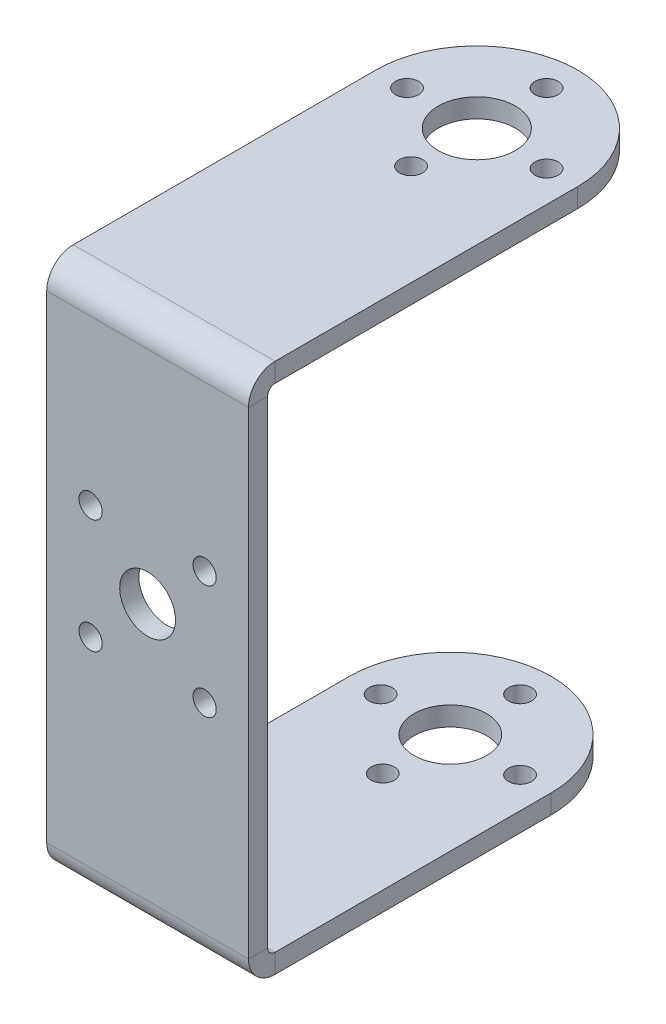
ISO-10303-21;
HEADER;
FILE_DESCRIPTION(('STEP AP214'),'2;1');
FILE_NAME('part.step','',(''),(''),'','','');
FILE_SCHEMA(('AUTOMOTIVE_DESIGN { 1 0 10303 214 1 1 1 1 }'));
ENDSEC;
DATA;
#1=APPLICATION_CONTEXT('core data for automotive mechanical design processes');
#2=APPLICATION_PROTOCOL_DEFINITION('international standard','automotive_design',2000,#1);
#3=PRODUCT_CONTEXT('',#1,'mechanical');
#4=PRODUCT('Part','Part','',(#3));
#5=PRODUCT_RELATED_PRODUCT_CATEGORY('part','',(#4));
#6=PRODUCT_DEFINITION_FORMATION('','',#4);
#7=PRODUCT_DEFINITION_CONTEXT('part definition',#1,'design');
#8=PRODUCT_DEFINITION('design','',#6,#7);
#9=PRODUCT_DEFINITION_SHAPE('','',#8);
#10=(LENGTH_UNIT() NAMED_UNIT(*) SI_UNIT(.MILLI.,.METRE.));
#11=(NAMED_UNIT(*) PLANE_ANGLE_UNIT() SI_UNIT($,.RADIAN.));
#12=(NAMED_UNIT(*) SI_UNIT($,.STERADIAN.) SOLID_ANGLE_UNIT());
#13=UNCERTAINTY_MEASURE_WITH_UNIT(LENGTH_MEASURE(1.E-05),#10,'distance_accuracy_value','');
#14=(GEOMETRIC_REPRESENTATION_CONTEXT(3) GLOBAL_UNCERTAINTY_ASSIGNED_CONTEXT((#13)) GLOBAL_UNIT_ASSIGNED_CONTEXT((#10,
#11,#12)) REPRESENTATION_CONTEXT('',''));
#15=CARTESIAN_POINT('',(0.,0.,0.));
#16=DIRECTION('',(0.,0.,1.));
#17=DIRECTION('',(1.,0.,0.));
#18=AXIS2_PLACEMENT_3D('',#15,#16,#17);
#19=CARTESIAN_POINT('',(-9.8223162915116,-29.2761050847723,-4.68905351014519));
#20=DIRECTION('',(0.,0.,-1.));
#21=DIRECTION('',(0.,1.,0.));
#22=AXIS2_PLACEMENT_3D('',#19,#20,#21);
#23=PLANE('',#22);
#24=CARTESIAN_POINT('',(-15.4723162915116,20.5516609165564,-4.68905351014536));
#25=DIRECTION('',(0.,0.,-1.));
#26=DIRECTION('',(0.,1.,0.));
#27=AXIS2_PLACEMENT_3D('',#24,#25,#26);
#28=CIRCLE('',#27,1.15);
#29=CARTESIAN_POINT('',(-15.4723162915116,21.7016609165564,-4.68905351014536));
#30=VERTEX_POINT('',#29);
#31=EDGE_CURVE('E291',#30,#30,#28,.T.);
#32=ORIENTED_EDGE('',*,*,#31,.T.);
#33=EDGE_LOOP('',(#32));
#34=FACE_BOUND('',#33,.T.);
#35=CARTESIAN_POINT('',(-9.8223162915116,26.2016609165564,-4.68905351014538));
#36=DIRECTION('',(0.,0.,-1.));
#37=DIRECTION('',(0.,1.,0.));
#38=AXIS2_PLACEMENT_3D('',#35,#36,#37);
#39=CIRCLE('',#38,2.765);
#40=CARTESIAN_POINT('',(-9.8223162915116,28.9666609165564,-4.68905351014539));
#41=VERTEX_POINT('',#40);
#42=EDGE_CURVE('E285',#41,#41,#39,.T.);
#43=ORIENTED_EDGE('',*,*,#42,.T.);
#44=EDGE_LOOP('',(#43));
#45=FACE_BOUND('',#44,.T.);
#46=CARTESIAN_POINT('',(-15.4723162915116,31.8516609165564,-4.6890535101454));
#47=DIRECTION('',(0.,0.,-1.));
#48=DIRECTION('',(0.,1.,0.));
#49=AXIS2_PLACEMENT_3D('',#46,#47,#48);
#50=CIRCLE('',#49,1.15);
#51=CARTESIAN_POINT('',(-15.4723162915116,33.0016609165564,-4.6890535101454));
#52=VERTEX_POINT('',#51);
#53=EDGE_CURVE('E279',#52,#52,#50,.T.);
#54=ORIENTED_EDGE('',*,*,#53,.T.);
#55=EDGE_LOOP('',(#54));
#56=FACE_BOUND('',#55,.T.);
#57=CARTESIAN_POINT('',(-4.1723162915116,20.5516609165564,-4.68905351014536));
#58=DIRECTION('',(0.,0.,-1.));
#59=DIRECTION('',(0.,1.,0.));
#60=AXIS2_PLACEMENT_3D('',#57,#58,#59);
#61=CIRCLE('',#60,1.15);
#62=CARTESIAN_POINT('',(-4.1723162915116,21.7016609165564,-4.68905351014536));
#63=VERTEX_POINT('',#62);
#64=EDGE_CURVE('E273',#63,#63,#61,.T.);
#65=ORIENTED_EDGE('',*,*,#64,.T.);
#66=EDGE_LOOP('',(#65));
#67=FACE_BOUND('',#66,.T.);
#68=CARTESIAN_POINT('',(-4.1723162915116,31.8516609165564,-4.6890535101454));
#69=DIRECTION('',(0.,0.,-1.));
#70=DIRECTION('',(0.,1.,0.));
#71=AXIS2_PLACEMENT_3D('',#68,#69,#70);
#72=CIRCLE('',#71,1.15);
#73=CARTESIAN_POINT('',(-4.1723162915116,33.0016609165564,-4.6890535101454));
#74=VERTEX_POINT('',#73);
#75=EDGE_CURVE('E267',#74,#74,#72,.T.);
#76=ORIENTED_EDGE('',*,*,#75,.T.);
#77=EDGE_LOOP('',(#76));
#78=FACE_BOUND('',#77,.T.);
#79=DIRECTION('',(0.,-1.,0.));
#80=VECTOR('',#79,1.);
#81=CARTESIAN_POINT('',(0.177683708488398,-29.2761050847723,-4.68905351014519));
#82=LINE('',#81,#80);
#83=CARTESIAN_POINT('',(0.177683708488407,48.0872949152277,-4.68905351014546));
#84=VERTEX_POINT('',#83);
#85=CARTESIAN_POINT('',(0.177683708488402,0.73660000000001,-4.68905351014529));
#86=VERTEX_POINT('',#85);
#87=EDGE_CURVE('E47',#84,#86,#82,.T.);
#88=ORIENTED_EDGE('',*,*,#87,.F.);
#89=DIRECTION('',(-1.,0.,0.));
#90=VECTOR('',#89,1.);
#91=CARTESIAN_POINT('',(-9.8223162915116,48.0872949152277,-4.68905351014546));
#92=LINE('',#91,#90);
#93=CARTESIAN_POINT('',(-19.8223162915116,48.0872949152277,-4.68905351014545));
#94=VERTEX_POINT('',#93);
#95=EDGE_CURVE('E305',#84,#94,#92,.T.);
#96=ORIENTED_EDGE('',*,*,#95,.T.);
#97=DIRECTION('',(0.,1.,0.));
#98=VECTOR('',#97,1.);
#99=CARTESIAN_POINT('',(-19.8223162915116,-29.2761050847723,-4.68905351014519));
#100=LINE('',#99,#98);
#101=CARTESIAN_POINT('',(-19.8223162915116,0.736600000000008,-4.68905351014529));
#102=VERTEX_POINT('',#101);
#103=EDGE_CURVE('E313',#102,#94,#100,.T.);
#104=ORIENTED_EDGE('',*,*,#103,.F.);
#105=DIRECTION('',(-1.,0.,0.));
#106=VECTOR('',#105,1.);
#107=CARTESIAN_POINT('',(-9.8223162915116,0.73660000000001,-4.68905351014529));
#108=LINE('',#107,#106);
#109=EDGE_CURVE('E296',#86,#102,#108,.T.);
#110=ORIENTED_EDGE('',*,*,#109,.F.);
#111=EDGE_LOOP('',(#88,#96,#104,#110));
#112=FACE_BOUND('',#111,.T.);
#113=ADVANCED_FACE('F43',(#34,#45,#56,#67,#78,#112),#23,.F.);
#114=CARTESIAN_POINT('',(0.177683708488398,-29.2761050847723,-4.68905351014519));
#115=DIRECTION('',(1.,0.,0.));
#116=DIRECTION('',(0.,-1.,0.));
#117=AXIS2_PLACEMENT_3D('',#114,#115,#116);
#118=PLANE('',#117);
#119=DIRECTION('',(0.,0.,-1.));
#120=VECTOR('',#119,1.);
#121=CARTESIAN_POINT('',(0.177683708488407,48.0872949152277,-4.68905351014546));
#122=LINE('',#121,#120);
#123=CARTESIAN_POINT('',(0.177683708488407,48.0872949152277,-6.58905351014546));
#124=VERTEX_POINT('',#123);
#125=EDGE_CURVE('E308',#84,#124,#122,.T.);
#126=ORIENTED_EDGE('',*,*,#125,.F.);
#127=ORIENTED_EDGE('',*,*,#87,.T.);
#128=DIRECTION('',(0.,0.,-1.));
#129=VECTOR('',#128,1.);
#130=CARTESIAN_POINT('',(0.177683708488402,0.73660000000001,-4.68905351014529));
#131=LINE('',#130,#129);
#132=CARTESIAN_POINT('',(0.177683708488402,0.736600000000003,-6.58905351014529));
#133=VERTEX_POINT('',#132);
#134=EDGE_CURVE('E303',#86,#133,#131,.T.);
#135=ORIENTED_EDGE('',*,*,#134,.T.);
#136=DIRECTION('',(0.,-1.,0.));
#137=VECTOR('',#136,1.);
#138=CARTESIAN_POINT('',(0.177683708488398,-29.2761050847723,-6.58905351014518));
#139=LINE('',#138,#137);
#140=EDGE_CURVE('E68',#124,#133,#139,.T.);
#141=ORIENTED_EDGE('',*,*,#140,.F.);
#142=EDGE_LOOP('',(#126,#127,#135,#141));
#143=FACE_BOUND('',#142,.T.);
#144=ADVANCED_FACE('F320',(#143),#118,.T.);
#145=CARTESIAN_POINT('',(-19.8223162915116,-29.2761050847723,-4.68905351014519));
#146=DIRECTION('',(-1.,0.,0.));
#147=DIRECTION('',(0.,1.,0.));
#148=AXIS2_PLACEMENT_3D('',#145,#146,#147);
#149=PLANE('',#148);
#150=DIRECTION('',(0.,0.,1.));
#151=VECTOR('',#150,1.);
#152=CARTESIAN_POINT('',(-19.8223162915116,48.0872949152277,-4.68905351014546));
#153=LINE('',#152,#151);
#154=CARTESIAN_POINT('',(-19.8223162915116,48.0872949152277,-6.58905351014546));
#155=VERTEX_POINT('',#154);
#156=EDGE_CURVE('E12',#155,#94,#153,.T.);
#157=ORIENTED_EDGE('',*,*,#156,.F.);
#158=DIRECTION('',(0.,1.,0.));
#159=VECTOR('',#158,1.);
#160=CARTESIAN_POINT('',(-19.8223162915116,-29.2761050847723,-6.58905351014518));
#161=LINE('',#160,#159);
#162=CARTESIAN_POINT('',(-19.8223162915116,0.736600000000003,-6.58905351014529));
#163=VERTEX_POINT('',#162);
#164=EDGE_CURVE('E60',#163,#155,#161,.T.);
#165=ORIENTED_EDGE('',*,*,#164,.F.);
#166=DIRECTION('',(0.,0.,1.));
#167=VECTOR('',#166,1.);
#168=CARTESIAN_POINT('',(-19.8223162915116,0.73660000000001,-4.68905351014529));
#169=LINE('',#168,#167);
#170=EDGE_CURVE('E299',#163,#102,#169,.T.);
#171=ORIENTED_EDGE('',*,*,#170,.T.);
#172=ORIENTED_EDGE('',*,*,#103,.T.);
#173=EDGE_LOOP('',(#157,#165,#171,#172));
#174=FACE_BOUND('',#173,.T.);
#175=ADVANCED_FACE('F45',(#174),#149,.T.);
#176=CARTESIAN_POINT('',(-9.8223162915116,-29.2761050847723,-6.58905351014518));
#177=DIRECTION('',(0.,0.,-1.));
#178=DIRECTION('',(0.,1.,0.));
#179=AXIS2_PLACEMENT_3D('',#176,#177,#178);
#180=PLANE('',#179);
#181=DIRECTION('',(-1.,0.,0.));
#182=VECTOR('',#181,1.);
#183=CARTESIAN_POINT('',(-9.8223162915116,48.0872949152277,-6.58905351014546));
#184=LINE('',#183,#182);
#185=EDGE_CURVE('E52',#124,#155,#184,.T.);
#186=ORIENTED_EDGE('',*,*,#185,.F.);
#187=ORIENTED_EDGE('',*,*,#140,.T.);
#188=DIRECTION('',(-1.,0.,0.));
#189=VECTOR('',#188,1.);
#190=CARTESIAN_POINT('',(-9.8223162915116,0.736600000000003,-6.58905351014529));
#191=LINE('',#190,#189);
#192=EDGE_CURVE('E301',#133,#163,#191,.T.);
#193=ORIENTED_EDGE('',*,*,#192,.T.);
#194=ORIENTED_EDGE('',*,*,#164,.T.);
#195=EDGE_LOOP('',(#186,#187,#193,#194));
#196=FACE_BOUND('',#195,.T.);
#197=CARTESIAN_POINT('',(-15.4723162915116,20.5516609165564,-6.58905351014536));
#198=DIRECTION('',(0.,0.,-1.));
#199=DIRECTION('',(0.,1.,0.));
#200=AXIS2_PLACEMENT_3D('',#197,#198,#199);
#201=CIRCLE('',#200,1.15);
#202=CARTESIAN_POINT('',(-15.4723162915116,21.7016609165564,-6.58905351014536));
#203=VERTEX_POINT('',#202);
#204=EDGE_CURVE('E288',#203,#203,#201,.T.);
#205=ORIENTED_EDGE('',*,*,#204,.F.);
#206=EDGE_LOOP('',(#205));
#207=FACE_BOUND('',#206,.T.);
#208=CARTESIAN_POINT('',(-9.8223162915116,26.2016609165564,-6.58905351014538));
#209=DIRECTION('',(0.,0.,-1.));
#210=DIRECTION('',(0.,1.,0.));
#211=AXIS2_PLACEMENT_3D('',#208,#209,#210);
#212=CIRCLE('',#211,2.765);
#213=CARTESIAN_POINT('',(-9.8223162915116,28.9666609165564,-6.58905351014539));
#214=VERTEX_POINT('',#213);
#215=EDGE_CURVE('E282',#214,#214,#212,.T.);
#216=ORIENTED_EDGE('',*,*,#215,.F.);
#217=EDGE_LOOP('',(#216));
#218=FACE_BOUND('',#217,.T.);
#219=CARTESIAN_POINT('',(-15.4723162915116,31.8516609165564,-6.5890535101454));
#220=DIRECTION('',(0.,0.,-1.));
#221=DIRECTION('',(0.,1.,0.));
#222=AXIS2_PLACEMENT_3D('',#219,#220,#221);
#223=CIRCLE('',#222,1.15);
#224=CARTESIAN_POINT('',(-15.4723162915116,33.0016609165564,-6.5890535101454));
#225=VERTEX_POINT('',#224);
#226=EDGE_CURVE('E276',#225,#225,#223,.T.);
#227=ORIENTED_EDGE('',*,*,#226,.F.);
#228=EDGE_LOOP('',(#227));
#229=FACE_BOUND('',#228,.T.);
#230=CARTESIAN_POINT('',(-4.1723162915116,20.5516609165564,-6.58905351014536));
#231=DIRECTION('',(0.,0.,-1.));
#232=DIRECTION('',(0.,1.,0.));
#233=AXIS2_PLACEMENT_3D('',#230,#231,#232);
#234=CIRCLE('',#233,1.15);
#235=CARTESIAN_POINT('',(-4.1723162915116,21.7016609165564,-6.58905351014536));
#236=VERTEX_POINT('',#235);
#237=EDGE_CURVE('E270',#236,#236,#234,.T.);
#238=ORIENTED_EDGE('',*,*,#237,.F.);
#239=EDGE_LOOP('',(#238));
#240=FACE_BOUND('',#239,.T.);
#241=CARTESIAN_POINT('',(-4.1723162915116,31.8516609165564,-6.5890535101454));
#242=DIRECTION('',(0.,0.,-1.));
#243=DIRECTION('',(0.,1.,0.));
#244=AXIS2_PLACEMENT_3D('',#241,#242,#243);
#245=CIRCLE('',#244,1.15);
#246=CARTESIAN_POINT('',(-4.1723162915116,33.0016609165564,-6.5890535101454));
#247=VERTEX_POINT('',#246);
#248=EDGE_CURVE('E209',#247,#247,#245,.T.);
#249=ORIENTED_EDGE('',*,*,#248,.F.);
#250=EDGE_LOOP('',(#249));
#251=FACE_BOUND('',#250,.T.);
#252=ADVANCED_FACE('F315',(#196,#207,#218,#229,#240,#251),#180,.T.);
#253=CARTESIAN_POINT('',(-15.4723162915116,20.5516609165564,-4.68905351014536));
#254=DIRECTION('',(0.,0.,-1.));
#255=DIRECTION('',(0.,1.,0.));
#256=AXIS2_PLACEMENT_3D('',#253,#254,#255);
#257=CYLINDRICAL_SURFACE('',#256,1.15);
#258=ORIENTED_EDGE('',*,*,#31,.F.);
#259=EDGE_LOOP('',(#258));
#260=FACE_BOUND('',#259,.T.);
#261=ORIENTED_EDGE('',*,*,#204,.T.);
#262=EDGE_LOOP('',(#261));
#263=FACE_BOUND('',#262,.T.);
#264=ADVANCED_FACE('F382',(#260,#263),#257,.F.);
#265=CARTESIAN_POINT('',(-9.8223162915116,26.2016609165564,-4.68905351014538));
#266=DIRECTION('',(0.,0.,-1.));
#267=DIRECTION('',(0.,1.,0.));
#268=AXIS2_PLACEMENT_3D('',#265,#266,#267);
#269=CYLINDRICAL_SURFACE('',#268,2.765);
#270=ORIENTED_EDGE('',*,*,#42,.F.);
#271=EDGE_LOOP('',(#270));
#272=FACE_BOUND('',#271,.T.);
#273=ORIENTED_EDGE('',*,*,#215,.T.);
#274=EDGE_LOOP('',(#273));
#275=FACE_BOUND('',#274,.T.);
#276=ADVANCED_FACE('F389',(#272,#275),#269,.F.);
#277=CARTESIAN_POINT('',(-15.4723162915116,31.8516609165564,-4.6890535101454));
#278=DIRECTION('',(0.,0.,-1.));
#279=DIRECTION('',(0.,1.,0.));
#280=AXIS2_PLACEMENT_3D('',#277,#278,#279);
#281=CYLINDRICAL_SURFACE('',#280,1.15);
#282=ORIENTED_EDGE('',*,*,#53,.F.);
#283=EDGE_LOOP('',(#282));
#284=FACE_BOUND('',#283,.T.);
#285=ORIENTED_EDGE('',*,*,#226,.T.);
#286=EDGE_LOOP('',(#285));
#287=FACE_BOUND('',#286,.T.);
#288=ADVANCED_FACE('F770',(#284,#287),#281,.F.);
#289=CARTESIAN_POINT('',(-4.1723162915116,20.5516609165564,-4.68905351014536));
#290=DIRECTION('',(0.,0.,-1.));
#291=DIRECTION('',(0.,1.,0.));
#292=AXIS2_PLACEMENT_3D('',#289,#290,#291);
#293=CYLINDRICAL_SURFACE('',#292,1.15);
#294=ORIENTED_EDGE('',*,*,#64,.F.);
#295=EDGE_LOOP('',(#294));
#296=FACE_BOUND('',#295,.T.);
#297=ORIENTED_EDGE('',*,*,#237,.T.);
#298=EDGE_LOOP('',(#297));
#299=FACE_BOUND('',#298,.T.);
#300=ADVANCED_FACE('F369',(#296,#299),#293,.F.);
#301=CARTESIAN_POINT('',(-4.1723162915116,31.8516609165564,-4.6890535101454));
#302=DIRECTION('',(0.,0.,-1.));
#303=DIRECTION('',(0.,1.,0.));
#304=AXIS2_PLACEMENT_3D('',#301,#302,#303);
#305=CYLINDRICAL_SURFACE('',#304,1.15);
#306=ORIENTED_EDGE('',*,*,#75,.F.);
#307=EDGE_LOOP('',(#306));
#308=FACE_BOUND('',#307,.T.);
#309=ORIENTED_EDGE('',*,*,#248,.T.);
#310=EDGE_LOOP('',(#309));
#311=FACE_BOUND('',#310,.T.);
#312=ADVANCED_FACE('F360',(#308,#311),#305,.F.);
#313=CARTESIAN_POINT('',(-9.8223162915116,-1.9,-34.6890535101453));
#314=DIRECTION('',(0.,1.,0.));
#315=DIRECTION('',(0.,0.,1.));
#316=AXIS2_PLACEMENT_3D('',#313,#314,#315);
#317=CYLINDRICAL_SURFACE('',#316,10.);
#318=CARTESIAN_POINT('',(-9.8223162915116,0.,-34.6890535101453));
#319=DIRECTION('',(0.,1.,0.));
#320=DIRECTION('',(0.,0.,1.));
#321=AXIS2_PLACEMENT_3D('',#318,#319,#320);
#322=CIRCLE('',#321,10.);
#323=CARTESIAN_POINT('',(0.177683708488398,0.,-34.6890535101453));
#324=VERTEX_POINT('',#323);
#325=CARTESIAN_POINT('',(-19.8223162915116,0.,-34.6890535101453));
#326=VERTEX_POINT('',#325);
#327=EDGE_CURVE('E214',#324,#326,#322,.T.);
#328=ORIENTED_EDGE('',*,*,#327,.F.);
#329=DIRECTION('',(0.,1.,0.));
#330=VECTOR('',#329,1.);
#331=CARTESIAN_POINT('',(0.177683708488398,-1.9,-34.6890535101453));
#332=LINE('',#331,#330);
#333=CARTESIAN_POINT('',(0.177683708488398,-1.9,-34.6890535101453));
#334=VERTEX_POINT('',#333);
#335=EDGE_CURVE('E206',#334,#324,#332,.T.);
#336=ORIENTED_EDGE('',*,*,#335,.F.);
#337=CARTESIAN_POINT('',(-9.8223162915116,-1.9,-34.6890535101453));
#338=DIRECTION('',(0.,1.,0.));
#339=DIRECTION('',(0.,0.,1.));
#340=AXIS2_PLACEMENT_3D('',#337,#338,#339);
#341=CIRCLE('',#340,10.);
#342=CARTESIAN_POINT('',(-19.8223162915116,-1.9,-34.6890535101453));
#343=VERTEX_POINT('',#342);
#344=EDGE_CURVE('E256',#334,#343,#341,.T.);
#345=ORIENTED_EDGE('',*,*,#344,.T.);
#346=DIRECTION('',(0.,1.,0.));
#347=VECTOR('',#346,1.);
#348=CARTESIAN_POINT('',(-19.8223162915116,-1.9,-34.6890535101453));
#349=LINE('',#348,#347);
#350=EDGE_CURVE('E254',#343,#326,#349,.T.);
#351=ORIENTED_EDGE('',*,*,#350,.T.);
#352=EDGE_LOOP('',(#328,#336,#345,#351));
#353=FACE_BOUND('',#352,.T.);
#354=ADVANCED_FACE('F357',(#353),#317,.T.);
#355=CARTESIAN_POINT('',(-9.8223162915116,-1.9,-27.9990291592585));
#356=DIRECTION('',(0.,1.,0.));
#357=DIRECTION('',(0.,0.,1.));
#358=AXIS2_PLACEMENT_3D('',#355,#356,#357);
#359=CYLINDRICAL_SURFACE('',#358,1.15);
#360=CARTESIAN_POINT('',(-9.8223162915116,-1.9,-27.9990291592585));
#361=DIRECTION('',(0.,1.,0.));
#362=DIRECTION('',(0.,0.,1.));
#363=AXIS2_PLACEMENT_3D('',#360,#361,#362);
#364=CIRCLE('',#363,1.15);
#365=CARTESIAN_POINT('',(-9.8223162915116,-1.9,-26.8490291592585));
#366=VERTEX_POINT('',#365);
#367=EDGE_CURVE('E224',#366,#366,#364,.T.);
#368=ORIENTED_EDGE('',*,*,#367,.F.);
#369=EDGE_LOOP('',(#368));
#370=FACE_BOUND('',#369,.T.);
#371=CARTESIAN_POINT('',(-9.8223162915116,0.,-27.9990291592585));
#372=DIRECTION('',(0.,1.,0.));
#373=DIRECTION('',(0.,0.,1.));
#374=AXIS2_PLACEMENT_3D('',#371,#372,#373);
#375=CIRCLE('',#374,1.15);
#376=CARTESIAN_POINT('',(-9.8223162915116,0.,-26.8490291592585));
#377=VERTEX_POINT('',#376);
#378=EDGE_CURVE('E251',#377,#377,#375,.T.);
#379=ORIENTED_EDGE('',*,*,#378,.T.);
#380=EDGE_LOOP('',(#379));
#381=FACE_BOUND('',#380,.T.);
#382=ADVANCED_FACE('F359',(#370,#381),#359,.F.);
#383=CARTESIAN_POINT('',(-9.8223162915116,-1.9,-41.6015535101453));
#384=DIRECTION('',(0.,1.,0.));
#385=DIRECTION('',(0.,0.,1.));
#386=AXIS2_PLACEMENT_3D('',#383,#384,#385);
#387=CYLINDRICAL_SURFACE('',#386,1.15);
#388=CARTESIAN_POINT('',(-9.8223162915116,-1.9,-41.6015535101453));
#389=DIRECTION('',(0.,1.,0.));
#390=DIRECTION('',(0.,0.,1.));
#391=AXIS2_PLACEMENT_3D('',#388,#389,#390);
#392=CIRCLE('',#391,1.15);
#393=CARTESIAN_POINT('',(-9.8223162915116,-1.9,-40.4515535101453));
#394=VERTEX_POINT('',#393);
#395=EDGE_CURVE('E227',#394,#394,#392,.T.);
#396=ORIENTED_EDGE('',*,*,#395,.F.);
#397=EDGE_LOOP('',(#396));
#398=FACE_BOUND('',#397,.T.);
#399=CARTESIAN_POINT('',(-9.8223162915116,0.,-41.6015535101453));
#400=DIRECTION('',(0.,1.,0.));
#401=DIRECTION('',(0.,0.,1.));
#402=AXIS2_PLACEMENT_3D('',#399,#400,#401);
#403=CIRCLE('',#402,1.15);
#404=CARTESIAN_POINT('',(-9.8223162915116,0.,-40.4515535101453));
#405=VERTEX_POINT('',#404);
#406=EDGE_CURVE('E248',#405,#405,#403,.T.);
#407=ORIENTED_EDGE('',*,*,#406,.T.);
#408=EDGE_LOOP('',(#407));
#409=FACE_BOUND('',#408,.T.);
#410=ADVANCED_FACE('F366',(#398,#409),#387,.F.);
#411=CARTESIAN_POINT('',(-2.9098162915116,-1.9,-34.6890535101453));
#412=DIRECTION('',(0.,1.,0.));
#413=DIRECTION('',(0.,0.,1.));
#414=AXIS2_PLACEMENT_3D('',#411,#412,#413);
#415=CYLINDRICAL_SURFACE('',#414,1.15);
#416=CARTESIAN_POINT('',(-2.9098162915116,-1.9,-34.6890535101453));
#417=DIRECTION('',(0.,1.,0.));
#418=DIRECTION('',(0.,0.,1.));
#419=AXIS2_PLACEMENT_3D('',#416,#417,#418);
#420=CIRCLE('',#419,1.15);
#421=CARTESIAN_POINT('',(-2.9098162915116,-1.9,-33.5390535101453));
#422=VERTEX_POINT('',#421);
#423=EDGE_CURVE('E230',#422,#422,#420,.T.);
#424=ORIENTED_EDGE('',*,*,#423,.F.);
#425=EDGE_LOOP('',(#424));
#426=FACE_BOUND('',#425,.T.);
#427=CARTESIAN_POINT('',(-2.9098162915116,0.,-34.6890535101453));
#428=DIRECTION('',(0.,1.,0.));
#429=DIRECTION('',(0.,0.,1.));
#430=AXIS2_PLACEMENT_3D('',#427,#428,#429);
#431=CIRCLE('',#430,1.15);
#432=CARTESIAN_POINT('',(-2.9098162915116,0.,-33.5390535101453));
#433=VERTEX_POINT('',#432);
#434=EDGE_CURVE('E245',#433,#433,#431,.T.);
#435=ORIENTED_EDGE('',*,*,#434,.T.);
#436=EDGE_LOOP('',(#435));
#437=FACE_BOUND('',#436,.T.);
#438=ADVANCED_FACE('F724',(#426,#437),#415,.F.);
#439=CARTESIAN_POINT('',(-16.7348162915116,-1.9,-34.6890535101453));
#440=DIRECTION('',(0.,1.,0.));
#441=DIRECTION('',(0.,0.,1.));
#442=AXIS2_PLACEMENT_3D('',#439,#440,#441);
#443=CYLINDRICAL_SURFACE('',#442,1.15);
#444=CARTESIAN_POINT('',(-16.7348162915116,-1.9,-34.6890535101453));
#445=DIRECTION('',(0.,1.,0.));
#446=DIRECTION('',(0.,0.,1.));
#447=AXIS2_PLACEMENT_3D('',#444,#445,#446);
#448=CIRCLE('',#447,1.15);
#449=CARTESIAN_POINT('',(-16.7348162915116,-1.9,-33.5390535101453));
#450=VERTEX_POINT('',#449);
#451=EDGE_CURVE('E233',#450,#450,#448,.T.);
#452=ORIENTED_EDGE('',*,*,#451,.F.);
#453=EDGE_LOOP('',(#452));
#454=FACE_BOUND('',#453,.T.);
#455=CARTESIAN_POINT('',(-16.7348162915116,0.,-34.6890535101453));
#456=DIRECTION('',(0.,1.,0.));
#457=DIRECTION('',(0.,0.,1.));
#458=AXIS2_PLACEMENT_3D('',#455,#456,#457);
#459=CIRCLE('',#458,1.15);
#460=CARTESIAN_POINT('',(-16.7348162915116,0.,-33.5390535101453));
#461=VERTEX_POINT('',#460);
#462=EDGE_CURVE('E242',#461,#461,#459,.T.);
#463=ORIENTED_EDGE('',*,*,#462,.T.);
#464=EDGE_LOOP('',(#463));
#465=FACE_BOUND('',#464,.T.);
#466=ADVANCED_FACE('F713',(#454,#465),#443,.F.);
#467=CARTESIAN_POINT('',(-9.8223162915116,-1.9,-34.6890535101453));
#468=DIRECTION('',(0.,1.,0.));
#469=DIRECTION('',(0.,0.,1.));
#470=AXIS2_PLACEMENT_3D('',#467,#468,#469);
#471=CYLINDRICAL_SURFACE('',#470,3.60002435088678);
#472=CARTESIAN_POINT('',(-9.8223162915116,-1.9,-34.6890535101453));
#473=DIRECTION('',(0.,1.,0.));
#474=DIRECTION('',(0.,0.,1.));
#475=AXIS2_PLACEMENT_3D('',#472,#473,#474);
#476=CIRCLE('',#475,3.60002435088678);
#477=CARTESIAN_POINT('',(-9.8223162915116,-1.9,-31.0890291592585));
#478=VERTEX_POINT('',#477);
#479=EDGE_CURVE('E236',#478,#478,#476,.T.);
#480=ORIENTED_EDGE('',*,*,#479,.F.);
#481=EDGE_LOOP('',(#480));
#482=FACE_BOUND('',#481,.T.);
#483=CARTESIAN_POINT('',(-9.8223162915116,0.,-34.6890535101453));
#484=DIRECTION('',(0.,1.,0.));
#485=DIRECTION('',(0.,0.,1.));
#486=AXIS2_PLACEMENT_3D('',#483,#484,#485);
#487=CIRCLE('',#486,3.60002435088678);
#488=CARTESIAN_POINT('',(-9.8223162915116,0.,-31.0890291592585));
#489=VERTEX_POINT('',#488);
#490=EDGE_CURVE('E239',#489,#489,#487,.T.);
#491=ORIENTED_EDGE('',*,*,#490,.T.);
#492=EDGE_LOOP('',(#491));
#493=FACE_BOUND('',#492,.T.);
#494=ADVANCED_FACE('F703',(#482,#493),#471,.F.);
#495=CARTESIAN_POINT('',(-9.8223162915116,-1.9,-34.6890535101453));
#496=DIRECTION('',(0.,1.,0.));
#497=DIRECTION('',(0.,0.,1.));
#498=AXIS2_PLACEMENT_3D('',#495,#496,#497);
#499=PLANE('',#498);
#500=ORIENTED_EDGE('',*,*,#479,.T.);
#501=EDGE_LOOP('',(#500));
#502=FACE_BOUND('',#501,.T.);
#503=ORIENTED_EDGE('',*,*,#451,.T.);
#504=EDGE_LOOP('',(#503));
#505=FACE_BOUND('',#504,.T.);
#506=ORIENTED_EDGE('',*,*,#423,.T.);
#507=EDGE_LOOP('',(#506));
#508=FACE_BOUND('',#507,.T.);
#509=ORIENTED_EDGE('',*,*,#395,.T.);
#510=EDGE_LOOP('',(#509));
#511=FACE_BOUND('',#510,.T.);
#512=ORIENTED_EDGE('',*,*,#367,.T.);
#513=EDGE_LOOP('',(#512));
#514=FACE_BOUND('',#513,.T.);
#515=DIRECTION('',(0.,0.,-1.));
#516=VECTOR('',#515,1.);
#517=CARTESIAN_POINT('',(0.177683708488398,-1.9,-34.6890535101453));
#518=LINE('',#517,#516);
#519=CARTESIAN_POINT('',(0.177683708488401,-1.9,-7.32565351014529));
#520=VERTEX_POINT('',#519);
#521=EDGE_CURVE('E210',#520,#334,#518,.T.);
#522=ORIENTED_EDGE('',*,*,#521,.F.);
#523=DIRECTION('',(-1.,0.,0.));
#524=VECTOR('',#523,1.);
#525=CARTESIAN_POINT('',(-9.8223162915116,-1.9,-7.32565351014529));
#526=LINE('',#525,#524);
#527=CARTESIAN_POINT('',(-19.8223162915116,-1.9,-7.32565351014529));
#528=VERTEX_POINT('',#527);
#529=EDGE_CURVE('E221',#520,#528,#526,.T.);
#530=ORIENTED_EDGE('',*,*,#529,.T.);
#531=DIRECTION('',(0.,0.,1.));
#532=VECTOR('',#531,1.);
#533=CARTESIAN_POINT('',(-19.8223162915116,-1.9,-34.6890535101453));
#534=LINE('',#533,#532);
#535=EDGE_CURVE('E219',#343,#528,#534,.T.);
#536=ORIENTED_EDGE('',*,*,#535,.F.);
#537=ORIENTED_EDGE('',*,*,#344,.F.);
#538=EDGE_LOOP('',(#522,#530,#536,#537));
#539=FACE_BOUND('',#538,.T.);
#540=ADVANCED_FACE('F354',(#502,#505,#508,#511,#514,#539),#499,.F.);
#541=CARTESIAN_POINT('',(-19.8223162915116,-1.9,-34.6890535101453));
#542=DIRECTION('',(-1.,0.,0.));
#543=DIRECTION('',(0.,0.,1.));
#544=AXIS2_PLACEMENT_3D('',#541,#542,#543);
#545=PLANE('',#544);
#546=DIRECTION('',(0.,-1.,0.));
#547=VECTOR('',#546,1.);
#548=CARTESIAN_POINT('',(-19.8223162915116,-1.9,-7.32565351014529));
#549=LINE('',#548,#547);
#550=CARTESIAN_POINT('',(-19.8223162915116,0.,-7.32565351014529));
#551=VERTEX_POINT('',#550);
#552=EDGE_CURVE('E259',#551,#528,#549,.T.);
#553=ORIENTED_EDGE('',*,*,#552,.F.);
#554=DIRECTION('',(0.,0.,1.));
#555=VECTOR('',#554,1.);
#556=CARTESIAN_POINT('',(-19.8223162915116,0.,-34.6890535101453));
#557=LINE('',#556,#555);
#558=EDGE_CURVE('E212',#326,#551,#557,.T.);
#559=ORIENTED_EDGE('',*,*,#558,.F.);
#560=ORIENTED_EDGE('',*,*,#350,.F.);
#561=ORIENTED_EDGE('',*,*,#535,.T.);
#562=EDGE_LOOP('',(#553,#559,#560,#561));
#563=FACE_BOUND('',#562,.T.);
#564=ADVANCED_FACE('F342',(#563),#545,.T.);
#565=CARTESIAN_POINT('',(-9.8223162915116,0.,-34.6890535101453));
#566=DIRECTION('',(0.,1.,0.));
#567=DIRECTION('',(0.,0.,1.));
#568=AXIS2_PLACEMENT_3D('',#565,#566,#567);
#569=PLANE('',#568);
#570=DIRECTION('',(-1.,0.,0.));
#571=VECTOR('',#570,1.);
#572=CARTESIAN_POINT('',(-9.8223162915116,0.,-7.32565351014529));
#573=LINE('',#572,#571);
#574=CARTESIAN_POINT('',(0.177683708488401,0.,-7.32565351014529));
#575=VERTEX_POINT('',#574);
#576=EDGE_CURVE('E262',#575,#551,#573,.T.);
#577=ORIENTED_EDGE('',*,*,#576,.F.);
#578=DIRECTION('',(0.,0.,-1.));
#579=VECTOR('',#578,1.);
#580=CARTESIAN_POINT('',(0.177683708488398,0.,-34.6890535101453));
#581=LINE('',#580,#579);
#582=EDGE_CURVE('E217',#575,#324,#581,.T.);
#583=ORIENTED_EDGE('',*,*,#582,.T.);
#584=ORIENTED_EDGE('',*,*,#327,.T.);
#585=ORIENTED_EDGE('',*,*,#558,.T.);
#586=EDGE_LOOP('',(#577,#583,#584,#585));
#587=FACE_BOUND('',#586,.T.);
#588=ORIENTED_EDGE('',*,*,#378,.F.);
#589=EDGE_LOOP('',(#588));
#590=FACE_BOUND('',#589,.T.);
#591=ORIENTED_EDGE('',*,*,#406,.F.);
#592=EDGE_LOOP('',(#591));
#593=FACE_BOUND('',#592,.T.);
#594=ORIENTED_EDGE('',*,*,#434,.F.);
#595=EDGE_LOOP('',(#594));
#596=FACE_BOUND('',#595,.T.);
#597=ORIENTED_EDGE('',*,*,#462,.F.);
#598=EDGE_LOOP('',(#597));
#599=FACE_BOUND('',#598,.T.);
#600=ORIENTED_EDGE('',*,*,#490,.F.);
#601=EDGE_LOOP('',(#600));
#602=FACE_BOUND('',#601,.T.);
#603=ADVANCED_FACE('F337',(#587,#590,#593,#596,#599,#602),#569,.T.);
#604=CARTESIAN_POINT('',(0.177683708488398,-1.9,-34.6890535101453));
#605=DIRECTION('',(1.,0.,0.));
#606=DIRECTION('',(0.,0.,-1.));
#607=AXIS2_PLACEMENT_3D('',#604,#605,#606);
#608=PLANE('',#607);
#609=DIRECTION('',(0.,1.,0.));
#610=VECTOR('',#609,1.);
#611=CARTESIAN_POINT('',(0.177683708488401,-1.9,-7.32565351014529));
#612=LINE('',#611,#610);
#613=EDGE_CURVE('E201',#520,#575,#612,.T.);
#614=ORIENTED_EDGE('',*,*,#613,.F.);
#615=ORIENTED_EDGE('',*,*,#521,.T.);
#616=ORIENTED_EDGE('',*,*,#335,.T.);
#617=ORIENTED_EDGE('',*,*,#582,.F.);
#618=EDGE_LOOP('',(#614,#615,#616,#617));
#619=FACE_BOUND('',#618,.T.);
#620=ADVANCED_FACE('F332',(#619),#608,.T.);
#621=CARTESIAN_POINT('',(0.177683708488401,0.7366,-7.32565351014529));
#622=DIRECTION('',(1.,0.,0.));
#623=DIRECTION('',(0.,0.,-1.));
#624=AXIS2_PLACEMENT_3D('',#621,#622,#623);
#625=PLANE('',#624);
#626=ORIENTED_EDGE('',*,*,#613,.T.);
#627=CARTESIAN_POINT('',(0.177683708488401,0.7366,-7.32565351014529));
#628=DIRECTION('',(-1.,0.,0.));
#629=DIRECTION('',(0.,0.,1.));
#630=AXIS2_PLACEMENT_3D('',#627,#628,#629);
#631=CIRCLE('',#630,0.7366);
#632=EDGE_CURVE('E189',#575,#133,#631,.T.);
#633=ORIENTED_EDGE('',*,*,#632,.T.);
#634=ORIENTED_EDGE('',*,*,#134,.F.);
#635=CARTESIAN_POINT('',(0.177683708488401,0.7366,-7.32565351014529));
#636=DIRECTION('',(-1.,0.,0.));
#637=DIRECTION('',(0.,0.,-1.));
#638=AXIS2_PLACEMENT_3D('',#635,#636,#637);
#639=CIRCLE('',#638,2.6366);
#640=EDGE_CURVE('E194',#520,#86,#639,.T.);
#641=ORIENTED_EDGE('',*,*,#640,.F.);
#642=EDGE_LOOP('',(#626,#633,#634,#641));
#643=FACE_BOUND('',#642,.T.);
#644=ADVANCED_FACE('F328',(#643),#625,.T.);
#645=CARTESIAN_POINT('',(-19.8223162915116,0.7366,-7.32565351014529));
#646=DIRECTION('',(-1.,0.,0.));
#647=DIRECTION('',(0.,0.,1.));
#648=AXIS2_PLACEMENT_3D('',#645,#646,#647);
#649=PLANE('',#648);
#650=ORIENTED_EDGE('',*,*,#170,.F.);
#651=CARTESIAN_POINT('',(-19.8223162915116,0.7366,-7.32565351014529));
#652=DIRECTION('',(-1.,0.,0.));
#653=DIRECTION('',(0.,0.,1.));
#654=AXIS2_PLACEMENT_3D('',#651,#652,#653);
#655=CIRCLE('',#654,0.7366);
#656=EDGE_CURVE('E198',#163,#551,#655,.F.);
#657=ORIENTED_EDGE('',*,*,#656,.T.);
#658=ORIENTED_EDGE('',*,*,#552,.T.);
#659=CARTESIAN_POINT('',(-19.8223162915116,0.7366,-7.32565351014529));
#660=DIRECTION('',(1.,0.,0.));
#661=DIRECTION('',(0.,0.,1.));
#662=AXIS2_PLACEMENT_3D('',#659,#660,#661);
#663=CIRCLE('',#662,2.6366);
#664=EDGE_CURVE('E197',#102,#528,#663,.T.);
#665=ORIENTED_EDGE('',*,*,#664,.F.);
#666=EDGE_LOOP('',(#650,#657,#658,#665));
#667=FACE_BOUND('',#666,.T.);
#668=ADVANCED_FACE('F346',(#667),#649,.T.);
#669=CARTESIAN_POINT('',(10.441662030432,0.7366,-7.32565351014529));
#670=DIRECTION('',(-1.,0.,0.));
#671=DIRECTION('',(0.,0.,1.));
#672=AXIS2_PLACEMENT_3D('',#669,#670,#671);
#673=CYLINDRICAL_SURFACE('',#672,2.6366);
#674=ORIENTED_EDGE('',*,*,#664,.T.);
#675=ORIENTED_EDGE('',*,*,#529,.F.);
#676=ORIENTED_EDGE('',*,*,#640,.T.);
#677=ORIENTED_EDGE('',*,*,#109,.T.);
#678=EDGE_LOOP('',(#674,#675,#676,#677));
#679=FACE_BOUND('',#678,.T.);
#680=ADVANCED_FACE('F352',(#679),#673,.T.);
#681=CARTESIAN_POINT('',(10.441662030432,0.7366,-7.32565351014529));
#682=DIRECTION('',(-1.,0.,0.));
#683=DIRECTION('',(0.,0.,1.));
#684=AXIS2_PLACEMENT_3D('',#681,#682,#683);
#685=CYLINDRICAL_SURFACE('',#684,0.7366);
#686=ORIENTED_EDGE('',*,*,#656,.F.);
#687=ORIENTED_EDGE('',*,*,#192,.F.);
#688=ORIENTED_EDGE('',*,*,#632,.F.);
#689=ORIENTED_EDGE('',*,*,#576,.T.);
#690=EDGE_LOOP('',(#686,#687,#688,#689));
#691=FACE_BOUND('',#690,.T.);
#692=ADVANCED_FACE('F327',(#691),#685,.F.);
#693=CARTESIAN_POINT('',(0.177683708488408,48.0872949152277,-7.32565351014546));
#694=DIRECTION('',(1.,0.,0.));
#695=DIRECTION('',(0.,0.,-1.));
#696=AXIS2_PLACEMENT_3D('',#693,#694,#695);
#697=PLANE('',#696);
#698=ORIENTED_EDGE('',*,*,#125,.T.);
#699=CARTESIAN_POINT('',(0.177683708488408,48.0872949152277,-7.32565351014546));
#700=DIRECTION('',(-1.,0.,0.));
#701=DIRECTION('',(0.,0.,1.));
#702=AXIS2_PLACEMENT_3D('',#699,#700,#701);
#703=CIRCLE('',#702,0.7366);
#704=CARTESIAN_POINT('',(0.177683708488408,48.8238949152277,-7.32565351014545));
#705=VERTEX_POINT('',#704);
#706=EDGE_CURVE('E153',#124,#705,#703,.T.);
#707=ORIENTED_EDGE('',*,*,#706,.T.);
#708=DIRECTION('',(0.,-1.,0.));
#709=VECTOR('',#708,1.);
#710=CARTESIAN_POINT('',(0.177683708488408,50.7238949152277,-7.32565351014547));
#711=LINE('',#710,#709);
#712=CARTESIAN_POINT('',(0.177683708488408,50.7238949152277,-7.32565351014547));
#713=VERTEX_POINT('',#712);
#714=EDGE_CURVE('E578',#713,#705,#711,.T.);
#715=ORIENTED_EDGE('',*,*,#714,.F.);
#716=CARTESIAN_POINT('',(0.177683708488408,48.0872949152277,-7.32565351014546));
#717=DIRECTION('',(-1.,0.,0.));
#718=DIRECTION('',(0.,0.,-1.));
#719=AXIS2_PLACEMENT_3D('',#716,#717,#718);
#720=CIRCLE('',#719,2.6366);
#721=EDGE_CURVE('E182',#84,#713,#720,.T.);
#722=ORIENTED_EDGE('',*,*,#721,.F.);
#723=EDGE_LOOP('',(#698,#707,#715,#722));
#724=FACE_BOUND('',#723,.T.);
#725=ADVANCED_FACE('F460',(#724),#697,.T.);
#726=CARTESIAN_POINT('',(-19.8223162915116,48.0872949152277,-7.32565351014546));
#727=DIRECTION('',(-1.,0.,0.));
#728=DIRECTION('',(0.,0.,1.));
#729=AXIS2_PLACEMENT_3D('',#726,#727,#728);
#730=PLANE('',#729);
#731=DIRECTION('',(0.,1.,0.));
#732=VECTOR('',#731,1.);
#733=CARTESIAN_POINT('',(-19.8223162915116,50.7238949152277,-7.32565351014548));
#734=LINE('',#733,#732);
#735=CARTESIAN_POINT('',(-19.8223162915116,48.8238949152277,-7.32565351014546));
#736=VERTEX_POINT('',#735);
#737=CARTESIAN_POINT('',(-19.8223162915116,50.7238949152277,-7.32565351014547));
#738=VERTEX_POINT('',#737);
#739=EDGE_CURVE('E141',#736,#738,#734,.T.);
#740=ORIENTED_EDGE('',*,*,#739,.F.);
#741=CARTESIAN_POINT('',(-19.8223162915116,48.0872949152277,-7.32565351014546));
#742=DIRECTION('',(-1.,0.,0.));
#743=DIRECTION('',(0.,0.,1.));
#744=AXIS2_PLACEMENT_3D('',#741,#742,#743);
#745=CIRCLE('',#744,0.7366);
#746=EDGE_CURVE('E186',#736,#155,#745,.F.);
#747=ORIENTED_EDGE('',*,*,#746,.T.);
#748=ORIENTED_EDGE('',*,*,#156,.T.);
#749=CARTESIAN_POINT('',(-19.8223162915116,48.0872949152277,-7.32565351014546));
#750=DIRECTION('',(1.,0.,0.));
#751=DIRECTION('',(0.,0.,1.));
#752=AXIS2_PLACEMENT_3D('',#749,#750,#751);
#753=CIRCLE('',#752,2.6366);
#754=EDGE_CURVE('E185',#738,#94,#753,.T.);
#755=ORIENTED_EDGE('',*,*,#754,.F.);
#756=EDGE_LOOP('',(#740,#747,#748,#755));
#757=FACE_BOUND('',#756,.T.);
#758=ADVANCED_FACE('F470',(#757),#730,.T.);
#759=CARTESIAN_POINT('',(10.441662030432,48.0872949152277,-7.32565351014546));
#760=DIRECTION('',(-1.,0.,0.));
#761=DIRECTION('',(0.,0.,1.));
#762=AXIS2_PLACEMENT_3D('',#759,#760,#761);
#763=CYLINDRICAL_SURFACE('',#762,2.6366);
#764=ORIENTED_EDGE('',*,*,#754,.T.);
#765=ORIENTED_EDGE('',*,*,#95,.F.);
#766=ORIENTED_EDGE('',*,*,#721,.T.);
#767=DIRECTION('',(-1.,0.,0.));
#768=VECTOR('',#767,1.);
#769=CARTESIAN_POINT('',(-9.8223162915116,50.7238949152277,-7.32565351014548));
#770=LINE('',#769,#768);
#771=EDGE_CURVE('E180',#713,#738,#770,.T.);
#772=ORIENTED_EDGE('',*,*,#771,.T.);
#773=EDGE_LOOP('',(#764,#765,#766,#772));
#774=FACE_BOUND('',#773,.T.);
#775=ADVANCED_FACE('F481',(#774),#763,.T.);
#776=CARTESIAN_POINT('',(10.441662030432,48.0872949152277,-7.32565351014546));
#777=DIRECTION('',(-1.,0.,0.));
#778=DIRECTION('',(0.,0.,1.));
#779=AXIS2_PLACEMENT_3D('',#776,#777,#778);
#780=CYLINDRICAL_SURFACE('',#779,0.7366);
#781=ORIENTED_EDGE('',*,*,#746,.F.);
#782=DIRECTION('',(-1.,0.,0.));
#783=VECTOR('',#782,1.);
#784=CARTESIAN_POINT('',(-9.8223162915116,48.8238949152277,-7.32565351014546));
#785=LINE('',#784,#783);
#786=EDGE_CURVE('E577',#705,#736,#785,.T.);
#787=ORIENTED_EDGE('',*,*,#786,.F.);
#788=ORIENTED_EDGE('',*,*,#706,.F.);
#789=ORIENTED_EDGE('',*,*,#185,.T.);
#790=EDGE_LOOP('',(#781,#787,#788,#789));
#791=FACE_BOUND('',#790,.T.);
#792=ADVANCED_FACE('F492',(#791),#780,.F.);
#793=CARTESIAN_POINT('',(-9.8223162915116,50.7238949152275,-37.3129484253732));
#794=DIRECTION('',(0.,-1.,0.));
#795=DIRECTION('',(0.,0.,-1.));
#796=AXIS2_PLACEMENT_3D('',#793,#794,#795);
#797=CYLINDRICAL_SURFACE('',#796,3.825);
#798=CARTESIAN_POINT('',(-9.8223162915116,50.7238949152275,-37.3129484253732));
#799=DIRECTION('',(0.,-1.,0.));
#800=DIRECTION('',(0.,0.,-1.));
#801=AXIS2_PLACEMENT_3D('',#798,#799,#800);
#802=CIRCLE('',#801,3.825);
#803=CARTESIAN_POINT('',(-9.8223162915116,50.7238949152275,-41.1379484253732));
#804=VERTEX_POINT('',#803);
#805=EDGE_CURVE('E568',#804,#804,#802,.T.);
#806=ORIENTED_EDGE('',*,*,#805,.F.);
#807=EDGE_LOOP('',(#806));
#808=FACE_BOUND('',#807,.T.);
#809=CARTESIAN_POINT('',(-9.8223162915116,48.8238949152275,-37.3129484253732));
#810=DIRECTION('',(0.,-1.,0.));
#811=DIRECTION('',(0.,0.,-1.));
#812=AXIS2_PLACEMENT_3D('',#809,#810,#811);
#813=CIRCLE('',#812,3.825);
#814=CARTESIAN_POINT('',(-9.8223162915116,48.8238949152275,-41.1379484253732));
#815=VERTEX_POINT('',#814);
#816=EDGE_CURVE('E177',#815,#815,#813,.T.);
#817=ORIENTED_EDGE('',*,*,#816,.T.);
#818=EDGE_LOOP('',(#817));
#819=FACE_BOUND('',#818,.T.);
#820=ADVANCED_FACE('F503',(#808,#819),#797,.F.);
#821=CARTESIAN_POINT('',(-16.7348162915116,50.7238949152275,-37.3129484253732));
#822=DIRECTION('',(0.,-1.,0.));
#823=DIRECTION('',(0.,0.,-1.));
#824=AXIS2_PLACEMENT_3D('',#821,#822,#823);
#825=CYLINDRICAL_SURFACE('',#824,1.15);
#826=CARTESIAN_POINT('',(-16.7348162915116,50.7238949152275,-37.3129484253732));
#827=DIRECTION('',(0.,-1.,0.));
#828=DIRECTION('',(0.,0.,-1.));
#829=AXIS2_PLACEMENT_3D('',#826,#827,#828);
#830=CIRCLE('',#829,1.15);
#831=CARTESIAN_POINT('',(-16.7348162915116,50.7238949152275,-38.4629484253732));
#832=VERTEX_POINT('',#831);
#833=EDGE_CURVE('E594',#832,#832,#830,.T.);
#834=ORIENTED_EDGE('',*,*,#833,.F.);
#835=EDGE_LOOP('',(#834));
#836=FACE_BOUND('',#835,.T.);
#837=CARTESIAN_POINT('',(-16.7348162915116,48.8238949152275,-37.3129484253732));
#838=DIRECTION('',(0.,-1.,0.));
#839=DIRECTION('',(0.,0.,-1.));
#840=AXIS2_PLACEMENT_3D('',#837,#838,#839);
#841=CIRCLE('',#840,1.15);
#842=CARTESIAN_POINT('',(-16.7348162915116,48.8238949152275,-38.4629484253732));
#843=VERTEX_POINT('',#842);
#844=EDGE_CURVE('E174',#843,#843,#841,.T.);
#845=ORIENTED_EDGE('',*,*,#844,.T.);
#846=EDGE_LOOP('',(#845));
#847=FACE_BOUND('',#846,.T.);
#848=ADVANCED_FACE('F557',(#836,#847),#825,.F.);
#849=CARTESIAN_POINT('',(-9.8223162915116,50.7238949152275,-44.2254484253732));
#850=DIRECTION('',(0.,-1.,0.));
#851=DIRECTION('',(0.,0.,-1.));
#852=AXIS2_PLACEMENT_3D('',#849,#850,#851);
#853=CYLINDRICAL_SURFACE('',#852,1.15);
#854=CARTESIAN_POINT('',(-9.8223162915116,50.7238949152275,-44.2254484253732));
#855=DIRECTION('',(0.,-1.,0.));
#856=DIRECTION('',(0.,0.,-1.));
#857=AXIS2_PLACEMENT_3D('',#854,#855,#856);
#858=CIRCLE('',#857,1.15);
#859=CARTESIAN_POINT('',(-9.8223162915116,50.7238949152275,-45.3754484253732));
#860=VERTEX_POINT('',#859);
#861=EDGE_CURVE('E597',#860,#860,#858,.T.);
#862=ORIENTED_EDGE('',*,*,#861,.F.);
#863=EDGE_LOOP('',(#862));
#864=FACE_BOUND('',#863,.T.);
#865=CARTESIAN_POINT('',(-9.8223162915116,48.8238949152275,-44.2254484253732));
#866=DIRECTION('',(0.,-1.,0.));
#867=DIRECTION('',(0.,0.,-1.));
#868=AXIS2_PLACEMENT_3D('',#865,#866,#867);
#869=CIRCLE('',#868,1.15);
#870=CARTESIAN_POINT('',(-9.8223162915116,48.8238949152275,-45.3754484253732));
#871=VERTEX_POINT('',#870);
#872=EDGE_CURVE('E171',#871,#871,#869,.T.);
#873=ORIENTED_EDGE('',*,*,#872,.T.);
#874=EDGE_LOOP('',(#873));
#875=FACE_BOUND('',#874,.T.);
#876=ADVANCED_FACE('F553',(#864,#875),#853,.F.);
#877=CARTESIAN_POINT('',(-2.90981629151159,50.7238949152275,-37.3129484253732));
#878=DIRECTION('',(0.,-1.,0.));
#879=DIRECTION('',(0.,0.,-1.));
#880=AXIS2_PLACEMENT_3D('',#877,#878,#879);
#881=CYLINDRICAL_SURFACE('',#880,1.15);
#882=CARTESIAN_POINT('',(-2.90981629151159,50.7238949152275,-37.3129484253732));
#883=DIRECTION('',(0.,-1.,0.));
#884=DIRECTION('',(0.,0.,-1.));
#885=AXIS2_PLACEMENT_3D('',#882,#883,#884);
#886=CIRCLE('',#885,1.15);
#887=CARTESIAN_POINT('',(-2.90981629151159,50.7238949152275,-38.4629484253732));
#888=VERTEX_POINT('',#887);
#889=EDGE_CURVE('E600',#888,#888,#886,.T.);
#890=ORIENTED_EDGE('',*,*,#889,.F.);
#891=EDGE_LOOP('',(#890));
#892=FACE_BOUND('',#891,.T.);
#893=CARTESIAN_POINT('',(-2.90981629151159,48.8238949152275,-37.3129484253732));
#894=DIRECTION('',(0.,-1.,0.));
#895=DIRECTION('',(0.,0.,-1.));
#896=AXIS2_PLACEMENT_3D('',#893,#894,#895);
#897=CIRCLE('',#896,1.15);
#898=CARTESIAN_POINT('',(-2.90981629151159,48.8238949152275,-38.4629484253732));
#899=VERTEX_POINT('',#898);
#900=EDGE_CURVE('E165',#899,#899,#897,.T.);
#901=ORIENTED_EDGE('',*,*,#900,.T.);
#902=EDGE_LOOP('',(#901));
#903=FACE_BOUND('',#902,.T.);
#904=ADVANCED_FACE('F549',(#892,#903),#881,.F.);
#905=CARTESIAN_POINT('',(-9.8223162915116,50.7238949152276,-30.7977445424684));
#906=DIRECTION('',(0.,-1.,0.));
#907=DIRECTION('',(0.,0.,-1.));
#908=AXIS2_PLACEMENT_3D('',#905,#906,#907);
#909=CYLINDRICAL_SURFACE('',#908,1.15);
#910=CARTESIAN_POINT('',(-9.8223162915116,50.7238949152276,-30.7977445424684));
#911=DIRECTION('',(0.,-1.,0.));
#912=DIRECTION('',(0.,0.,-1.));
#913=AXIS2_PLACEMENT_3D('',#910,#911,#912);
#914=CIRCLE('',#913,1.15);
#915=CARTESIAN_POINT('',(-9.8223162915116,50.7238949152276,-31.9477445424684));
#916=VERTEX_POINT('',#915);
#917=EDGE_CURVE('E162',#916,#916,#914,.T.);
#918=ORIENTED_EDGE('',*,*,#917,.F.);
#919=EDGE_LOOP('',(#918));
#920=FACE_BOUND('',#919,.T.);
#921=CARTESIAN_POINT('',(-9.8223162915116,48.8238949152276,-30.7977445424683));
#922=DIRECTION('',(0.,-1.,0.));
#923=DIRECTION('',(0.,0.,-1.));
#924=AXIS2_PLACEMENT_3D('',#921,#922,#923);
#925=CIRCLE('',#924,1.15);
#926=CARTESIAN_POINT('',(-9.8223162915116,48.8238949152276,-31.9477445424683));
#927=VERTEX_POINT('',#926);
#928=EDGE_CURVE('E160',#927,#927,#925,.T.);
#929=ORIENTED_EDGE('',*,*,#928,.T.);
#930=EDGE_LOOP('',(#929));
#931=FACE_BOUND('',#930,.T.);
#932=ADVANCED_FACE('F546',(#920,#931),#909,.F.);
#933=CARTESIAN_POINT('',(-9.8223162915116,50.7238949152275,-37.3129484253732));
#934=DIRECTION('',(0.,-1.,0.));
#935=DIRECTION('',(0.,0.,-1.));
#936=AXIS2_PLACEMENT_3D('',#933,#934,#935);
#937=CYLINDRICAL_SURFACE('',#936,10.);
#938=CARTESIAN_POINT('',(-9.8223162915116,48.8238949152275,-37.3129484253732));
#939=DIRECTION('',(0.,-1.,0.));
#940=DIRECTION('',(0.,0.,-1.));
#941=AXIS2_PLACEMENT_3D('',#938,#939,#940);
#942=CIRCLE('',#941,10.);
#943=CARTESIAN_POINT('',(-19.8223162915116,48.8238949152275,-37.3129484253732));
#944=VERTEX_POINT('',#943);
#945=CARTESIAN_POINT('',(0.177683708488405,48.8238949152275,-37.3129484253731));
#946=VERTEX_POINT('',#945);
#947=EDGE_CURVE('E152',#944,#946,#942,.T.);
#948=ORIENTED_EDGE('',*,*,#947,.F.);
#949=DIRECTION('',(0.,-1.,0.));
#950=VECTOR('',#949,1.);
#951=CARTESIAN_POINT('',(-19.8223162915116,50.7238949152275,-37.3129484253732));
#952=LINE('',#951,#950);
#953=CARTESIAN_POINT('',(-19.8223162915116,50.7238949152275,-37.3129484253732));
#954=VERTEX_POINT('',#953);
#955=EDGE_CURVE('E138',#954,#944,#952,.T.);
#956=ORIENTED_EDGE('',*,*,#955,.F.);
#957=CARTESIAN_POINT('',(-9.8223162915116,50.7238949152275,-37.3129484253732));
#958=DIRECTION('',(0.,-1.,0.));
#959=DIRECTION('',(0.,0.,-1.));
#960=AXIS2_PLACEMENT_3D('',#957,#958,#959);
#961=CIRCLE('',#960,10.);
#962=CARTESIAN_POINT('',(0.177683708488405,50.7238949152275,-37.3129484253731));
#963=VERTEX_POINT('',#962);
#964=EDGE_CURVE('E149',#954,#963,#961,.T.);
#965=ORIENTED_EDGE('',*,*,#964,.T.);
#966=DIRECTION('',(0.,-1.,0.));
#967=VECTOR('',#966,1.);
#968=CARTESIAN_POINT('',(0.177683708488405,50.7238949152275,-37.3129484253731));
#969=LINE('',#968,#967);
#970=EDGE_CURVE('E159',#963,#946,#969,.T.);
#971=ORIENTED_EDGE('',*,*,#970,.T.);
#972=EDGE_LOOP('',(#948,#956,#965,#971));
#973=FACE_BOUND('',#972,.T.);
#974=ADVANCED_FACE('F148',(#973),#937,.T.);
#975=CARTESIAN_POINT('',(-9.8223162915116,50.7238949152283,72.6870515746268));
#976=DIRECTION('',(0.,-1.,0.));
#977=DIRECTION('',(0.,0.,-1.));
#978=AXIS2_PLACEMENT_3D('',#975,#976,#977);
#979=PLANE('',#978);
#980=ORIENTED_EDGE('',*,*,#771,.F.);
#981=DIRECTION('',(0.,0.,1.));
#982=VECTOR('',#981,1.);
#983=CARTESIAN_POINT('',(0.177683708488398,50.7238949152283,72.6870515746268));
#984=LINE('',#983,#982);
#985=EDGE_CURVE('E158',#963,#713,#984,.T.);
#986=ORIENTED_EDGE('',*,*,#985,.F.);
#987=ORIENTED_EDGE('',*,*,#964,.F.);
#988=DIRECTION('',(0.,0.,-1.));
#989=VECTOR('',#988,1.);
#990=CARTESIAN_POINT('',(-19.8223162915116,50.7238949152283,72.6870515746268));
#991=LINE('',#990,#989);
#992=EDGE_CURVE('E135',#738,#954,#991,.T.);
#993=ORIENTED_EDGE('',*,*,#992,.F.);
#994=EDGE_LOOP('',(#980,#986,#987,#993));
#995=FACE_BOUND('',#994,.T.);
#996=ORIENTED_EDGE('',*,*,#917,.T.);
#997=EDGE_LOOP('',(#996));
#998=FACE_BOUND('',#997,.T.);
#999=ORIENTED_EDGE('',*,*,#889,.T.);
#1000=EDGE_LOOP('',(#999));
#1001=FACE_BOUND('',#1000,.T.);
#1002=ORIENTED_EDGE('',*,*,#861,.T.);
#1003=EDGE_LOOP('',(#1002));
#1004=FACE_BOUND('',#1003,.T.);
#1005=ORIENTED_EDGE('',*,*,#833,.T.);
#1006=EDGE_LOOP('',(#1005));
#1007=FACE_BOUND('',#1006,.T.);
#1008=ORIENTED_EDGE('',*,*,#805,.T.);
#1009=EDGE_LOOP('',(#1008));
#1010=FACE_BOUND('',#1009,.T.);
#1011=ADVANCED_FACE('F155',(#995,#998,#1001,#1004,#1007,#1010),#979,.F.);
#1012=CARTESIAN_POINT('',(0.177683708488398,50.7238949152283,72.6870515746268));
#1013=DIRECTION('',(1.,0.,0.));
#1014=DIRECTION('',(0.,0.,1.));
#1015=AXIS2_PLACEMENT_3D('',#1012,#1013,#1014);
#1016=PLANE('',#1015);
#1017=ORIENTED_EDGE('',*,*,#985,.T.);
#1018=ORIENTED_EDGE('',*,*,#714,.T.);
#1019=DIRECTION('',(0.,0.,1.));
#1020=VECTOR('',#1019,1.);
#1021=CARTESIAN_POINT('',(0.177683708488398,48.8238949152283,72.6870515746269));
#1022=LINE('',#1021,#1020);
#1023=EDGE_CURVE('E574',#946,#705,#1022,.T.);
#1024=ORIENTED_EDGE('',*,*,#1023,.F.);
#1025=ORIENTED_EDGE('',*,*,#970,.F.);
#1026=EDGE_LOOP('',(#1017,#1018,#1024,#1025));
#1027=FACE_BOUND('',#1026,.T.);
#1028=ADVANCED_FACE('F516',(#1027),#1016,.T.);
#1029=CARTESIAN_POINT('',(-9.8223162915116,48.8238949152283,72.6870515746268));
#1030=DIRECTION('',(0.,-1.,0.));
#1031=DIRECTION('',(0.,0.,-1.));
#1032=AXIS2_PLACEMENT_3D('',#1029,#1030,#1031);
#1033=PLANE('',#1032);
#1034=ORIENTED_EDGE('',*,*,#928,.F.);
#1035=EDGE_LOOP('',(#1034));
#1036=FACE_BOUND('',#1035,.T.);
#1037=ORIENTED_EDGE('',*,*,#900,.F.);
#1038=EDGE_LOOP('',(#1037));
#1039=FACE_BOUND('',#1038,.T.);
#1040=ORIENTED_EDGE('',*,*,#872,.F.);
#1041=EDGE_LOOP('',(#1040));
#1042=FACE_BOUND('',#1041,.T.);
#1043=ORIENTED_EDGE('',*,*,#844,.F.);
#1044=EDGE_LOOP('',(#1043));
#1045=FACE_BOUND('',#1044,.T.);
#1046=ORIENTED_EDGE('',*,*,#816,.F.);
#1047=EDGE_LOOP('',(#1046));
#1048=FACE_BOUND('',#1047,.T.);
#1049=ORIENTED_EDGE('',*,*,#1023,.T.);
#1050=ORIENTED_EDGE('',*,*,#786,.T.);
#1051=DIRECTION('',(0.,0.,-1.));
#1052=VECTOR('',#1051,1.);
#1053=CARTESIAN_POINT('',(-19.8223162915116,48.8238949152283,72.6870515746268));
#1054=LINE('',#1053,#1052);
#1055=EDGE_CURVE('E585',#736,#944,#1054,.T.);
#1056=ORIENTED_EDGE('',*,*,#1055,.T.);
#1057=ORIENTED_EDGE('',*,*,#947,.T.);
#1058=EDGE_LOOP('',(#1049,#1050,#1056,#1057));
#1059=FACE_BOUND('',#1058,.T.);
#1060=ADVANCED_FACE('F524',(#1036,#1039,#1042,#1045,#1048,#1059),#1033,.T.);
#1061=CARTESIAN_POINT('',(-19.8223162915116,50.7238949152283,72.6870515746268));
#1062=DIRECTION('',(-1.,0.,0.));
#1063=DIRECTION('',(0.,0.,-1.));
#1064=AXIS2_PLACEMENT_3D('',#1061,#1062,#1063);
#1065=PLANE('',#1064);
#1066=ORIENTED_EDGE('',*,*,#1055,.F.);
#1067=ORIENTED_EDGE('',*,*,#739,.T.);
#1068=ORIENTED_EDGE('',*,*,#992,.T.);
#1069=ORIENTED_EDGE('',*,*,#955,.T.);
#1070=EDGE_LOOP('',(#1066,#1067,#1068,#1069));
#1071=FACE_BOUND('',#1070,.T.);
#1072=ADVANCED_FACE('F137',(#1071),#1065,.T.);
#1073=CLOSED_SHELL('',(#113,#144,#175,#252,#264,#276,#288,#300,#312,#354,#382,#410,#438,#466,
#494,#540,#564,#603,#620,#644,#668,#680,#692,#725,#758,#775,#792,#820,#848,#876,#904,#932,#974,
#1011,#1028,#1060,#1072));
#1074=MANIFOLD_SOLID_BREP('B2',#1073);
#1075=ADVANCED_BREP_SHAPE_REPRESENTATION('',(#18,#1074),#14);
#1076=SHAPE_DEFINITION_REPRESENTATION(#9,#1075);
ENDSEC;
END-ISO-10303-21;
